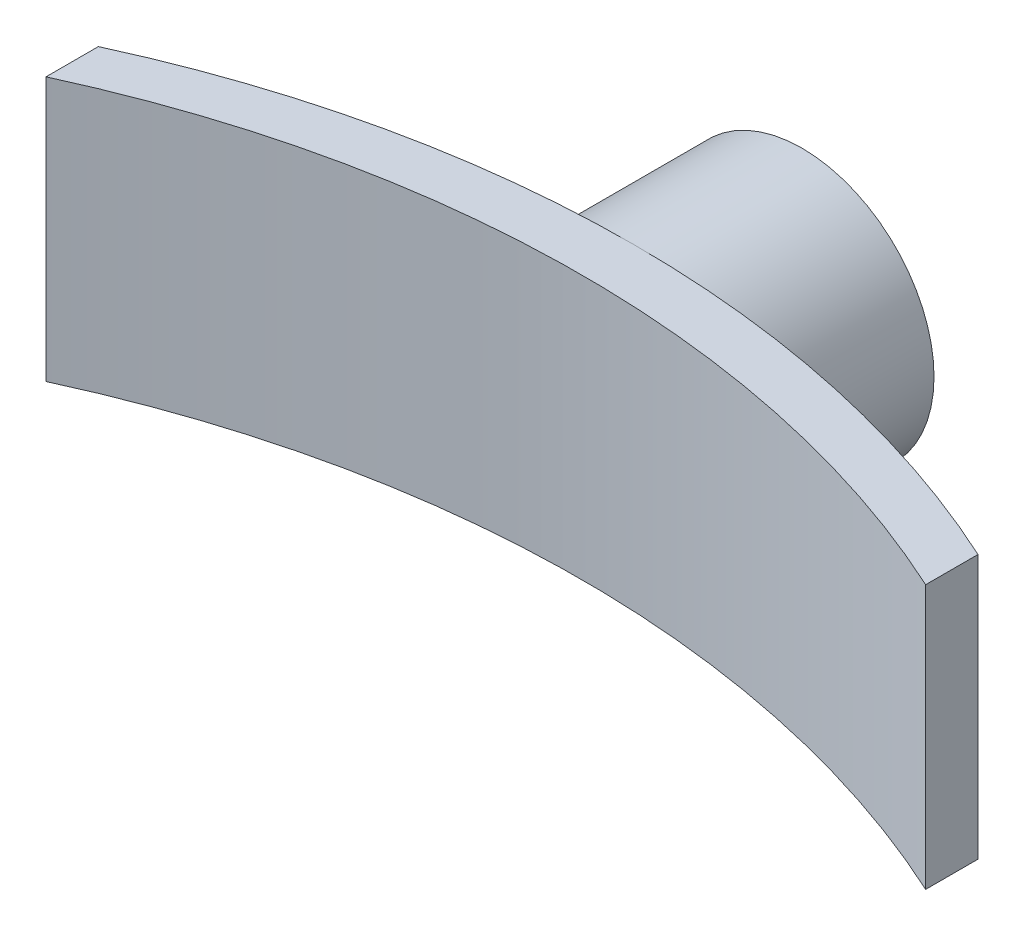
ISO-10303-21;
HEADER;
FILE_DESCRIPTION(('STEP AP214'),'2;1');
FILE_NAME('part.step','',(''),(''),'','','');
FILE_SCHEMA(('AUTOMOTIVE_DESIGN { 1 0 10303 214 1 1 1 1 }'));
ENDSEC;
DATA;
#1=APPLICATION_CONTEXT('core data for automotive mechanical design processes');
#2=APPLICATION_PROTOCOL_DEFINITION('international standard','automotive_design',2000,#1);
#3=PRODUCT_CONTEXT('',#1,'mechanical');
#4=PRODUCT('Part','Part','',(#3));
#5=PRODUCT_RELATED_PRODUCT_CATEGORY('part','',(#4));
#6=PRODUCT_DEFINITION_FORMATION('','',#4);
#7=PRODUCT_DEFINITION_CONTEXT('part definition',#1,'design');
#8=PRODUCT_DEFINITION('design','',#6,#7);
#9=PRODUCT_DEFINITION_SHAPE('','',#8);
#10=(LENGTH_UNIT() NAMED_UNIT(*) SI_UNIT(.MILLI.,.METRE.));
#11=(NAMED_UNIT(*) PLANE_ANGLE_UNIT() SI_UNIT($,.RADIAN.));
#12=(NAMED_UNIT(*) SI_UNIT($,.STERADIAN.) SOLID_ANGLE_UNIT());
#13=UNCERTAINTY_MEASURE_WITH_UNIT(LENGTH_MEASURE(1.E-05),#10,'distance_accuracy_value','');
#14=(GEOMETRIC_REPRESENTATION_CONTEXT(3) GLOBAL_UNCERTAINTY_ASSIGNED_CONTEXT((#13)) GLOBAL_UNIT_ASSIGNED_CONTEXT((#10,
#11,#12)) REPRESENTATION_CONTEXT('',''));
#15=CARTESIAN_POINT('',(0.,0.,0.));
#16=DIRECTION('',(0.,0.,1.));
#17=DIRECTION('',(1.,0.,0.));
#18=AXIS2_PLACEMENT_3D('',#15,#16,#17);
#19=CARTESIAN_POINT('',(0.,15.,138.685441024654));
#20=DIRECTION('',(0.,-1.,0.));
#21=DIRECTION('',(0.,0.,-1.));
#22=AXIS2_PLACEMENT_3D('',#19,#20,#21);
#23=CYLINDRICAL_SURFACE('',#22,119.634966003771);
#24=CARTESIAN_POINT('',(0.,-15.,138.685441024654));
#25=DIRECTION('',(0.,1.,0.));
#26=DIRECTION('',(0.,0.,1.));
#27=AXIS2_PLACEMENT_3D('',#24,#25,#26);
#28=CIRCLE('',#27,119.634966003771);
#29=CARTESIAN_POINT('',(50.,-15.,30.));
#30=VERTEX_POINT('',#29);
#31=CARTESIAN_POINT('',(0.,-15.,19.0504750208826));
#32=VERTEX_POINT('',#31);
#33=EDGE_CURVE('E93',#30,#32,#28,.T.);
#34=ORIENTED_EDGE('',*,*,#33,.T.);
#35=CARTESIAN_POINT('',(-15.,0.,19.9945606221414));
#36=CARTESIAN_POINT('',(-15.0000048297633,-0.419645091215443,19.99456229236));
#37=CARTESIAN_POINT('',(-14.9823835072018,-0.839219354657158,19.9923305711218));
#38=CARTESIAN_POINT('',(-14.9120337656221,-1.67550049008419,19.9834711187617));
#39=CARTESIAN_POINT('',(-14.8592973950176,-2.09220669101638,19.9768423919662));
#40=CARTESIAN_POINT('',(-14.719032338457,-2.92001939897791,19.9593691203172));
#41=CARTESIAN_POINT('',(-14.6314713819051,-3.33112034535046,19.9485206654107));
#42=CARTESIAN_POINT('',(-14.4222092568599,-4.14441584549623,19.9229213755418));
#43=CARTESIAN_POINT('',(-14.3005080970243,-4.54661040152801,19.9081705415691));
#44=CARTESIAN_POINT('',(-14.0239555181851,-5.3389730910945,19.8752010535054));
#45=CARTESIAN_POINT('',(-13.8691271517585,-5.72914937301504,19.8569848118964));
#46=CARTESIAN_POINT('',(-13.5273906518036,-6.49504026225926,19.8175969398735));
#47=CARTESIAN_POINT('',(-13.340482095909,-6.87075467909893,19.7964252705492));
#48=CARTESIAN_POINT('',(-12.9359617266996,-7.60503545625785,19.7517310710601));
#49=CARTESIAN_POINT('',(-12.7183555675124,-7.96360495821498,19.728208974048));
#50=CARTESIAN_POINT('',(-12.2539524107721,-8.66119080707835,19.6794738255989));
#51=CARTESIAN_POINT('',(-12.0071553850903,-9.00020713514234,19.6542607725325));
#52=CARTESIAN_POINT('',(-11.4847836220393,-9.65800301794134,19.6027217117517));
#53=CARTESIAN_POINT('',(-11.2090703344639,-9.97667216606313,19.5763907423995));
#54=CARTESIAN_POINT('',(-10.6318314620853,-10.5896840672006,19.523478861816));
#55=CARTESIAN_POINT('',(-10.3303057747809,-10.8840267236065,19.4968979495927));
#56=CARTESIAN_POINT('',(-9.70352824564511,-11.4463448461271,19.4442337373279));
#57=CARTESIAN_POINT('',(-9.37827524054865,-11.714319017975,19.418150461763));
#58=CARTESIAN_POINT('',(-8.70631903618782,-12.2220017069365,19.3672169125314));
#59=CARTESIAN_POINT('',(-8.35961582073267,-12.4617102027145,19.3423666397955));
#60=CARTESIAN_POINT('',(-7.64598441832916,-12.9119131677886,19.2945188251742));
#61=CARTESIAN_POINT('',(-7.27899260078468,-13.1223074795491,19.2715277426417));
#62=CARTESIAN_POINT('',(-6.52843051102123,-13.5114130080502,19.2281433374362));
#63=CARTESIAN_POINT('',(-6.14486018995756,-13.6901241314356,19.2077500224177));
#64=CARTESIAN_POINT('',(-5.36387171107389,-14.0145521891916,19.1701416420801));
#65=CARTESIAN_POINT('',(-4.96645395653608,-14.1602700835067,19.1529264842946));
#66=CARTESIAN_POINT('',(-4.16059835342893,-14.417639499442,19.1221645543267));
#67=CARTESIAN_POINT('',(-3.752160566962,-14.5292912129954,19.1086177614762));
#68=CARTESIAN_POINT('',(-2.92937506874225,-14.7171972344642,19.0856403270988));
#69=CARTESIAN_POINT('',(-2.51506983160761,-14.7936349382754,19.076188375208));
#70=CARTESIAN_POINT('',(-1.6814245605569,-14.9114056241703,19.0615651201498));
#71=CARTESIAN_POINT('',(-1.26208454250687,-14.9527387168494,19.0563938034965));
#72=CARTESIAN_POINT('',(-0.421397497431455,-14.9999888421127,19.0504787267864));
#73=CARTESIAN_POINT('',(-5.05412302096039E-05,-15.005907115341,19.0497348116297));
#74=CARTESIAN_POINT('',(0.841631858023303,-14.982286242833,19.0526952767451));
#75=CARTESIAN_POINT('',(1.26196730410946,-14.9527472035791,19.0563996436583));
#76=CARTESIAN_POINT('',(2.09624967574315,-14.8586999986219,19.0681182806827));
#77=CARTESIAN_POINT('',(2.51021923400308,-14.7943894042729,19.076108198345));
#78=CARTESIAN_POINT('',(3.33123484927159,-14.6314056434909,19.0961581001873));
#79=CARTESIAN_POINT('',(3.73828093644517,-14.5327326268125,19.1082180666297));
#80=CARTESIAN_POINT('',(4.54258693357236,-14.3017472075734,19.1360707516105));
#81=CARTESIAN_POINT('',(4.9398467141506,-14.1694343605543,19.1518635194675));
#82=CARTESIAN_POINT('',(5.72179470888925,-13.8721312549127,19.1867408662134));
#83=CARTESIAN_POINT('',(6.1064828716813,-13.7071408627874,19.2058254585508));
#84=CARTESIAN_POINT('',(6.86163192092546,-13.345178816002,19.2468104002197));
#85=CARTESIAN_POINT('',(7.23205156019883,-13.1481219591201,19.268718217819));
#86=CARTESIAN_POINT('',(7.95498974724141,-12.7237503412394,19.3146973697392));
#87=CARTESIAN_POINT('',(8.30750827466361,-12.4964355458493,19.3387687065192));
#88=CARTESIAN_POINT('',(8.99222272660967,-12.0131402824668,19.3884047090856));
#89=CARTESIAN_POINT('',(9.32441785933424,-11.7571586987149,19.4139694329787));
#90=CARTESIAN_POINT('',(9.96618263165715,-11.2183224213179,19.4658790414952));
#91=CARTESIAN_POINT('',(10.2757521618891,-10.9354675977897,19.492223929889));
#92=CARTESIAN_POINT('',(10.872178148859,-10.3428089267873,19.5451409402041));
#93=CARTESIAN_POINT('',(11.1588635896263,-10.0328329761059,19.571713377987));
#94=CARTESIAN_POINT('',(11.7051208026639,-9.38978831220435,19.6241519701445));
#95=CARTESIAN_POINT('',(11.9646924429434,-9.05671948658056,19.6500181210804));
#96=CARTESIAN_POINT('',(12.4548885346383,-8.36981387147465,19.7003092940268));
#97=CARTESIAN_POINT('',(12.6855128140142,-8.01597695858232,19.7247343074719));
#98=CARTESIAN_POINT('',(13.1161657520844,-7.29001478229278,19.7714459636339));
#99=CARTESIAN_POINT('',(13.3161944695897,-6.91788955405135,19.793732610461));
#100=CARTESIAN_POINT('',(13.6842925603756,-6.15780163905306,19.8355374668059));
#101=CARTESIAN_POINT('',(13.8523479363991,-5.76983210585522,19.8550544628831));
#102=CARTESIAN_POINT('',(14.155160424469,-4.98095741937975,19.8907450755208));
#103=CARTESIAN_POINT('',(14.2899175007474,-4.58005225220764,19.90691868849));
#104=CARTESIAN_POINT('',(14.5251293250313,-3.76818567136168,19.9354525682793));
#105=CARTESIAN_POINT('',(14.6255854347246,-3.35722465758144,19.9478129864747));
#106=CARTESIAN_POINT('',(14.7914491723722,-2.5281873861845,19.9683608807801));
#107=CARTESIAN_POINT('',(14.8568570106262,-2.11011117127659,19.9765483819288));
#108=CARTESIAN_POINT('',(14.951807121792,-1.27272060923652,19.9884704171227));
#109=CARTESIAN_POINT('',(14.9815899056199,-0.853433943910768,19.9922348092498));
#110=CARTESIAN_POINT('',(15.0058718473248,-0.0138247347406407,19.9953022039866));
#111=CARTESIAN_POINT('',(15.0003711639494,0.406497804434612,19.9946052266689));
#112=CARTESIAN_POINT('',(14.9541281384468,1.24515940660474,19.9887701285481));
#113=CARTESIAN_POINT('',(14.9133865184966,1.66349851006867,19.9836320987536));
#114=CARTESIAN_POINT('',(14.7969675555985,2.49521051941395,19.9690635711383));
#115=CARTESIAN_POINT('',(14.7212902323457,2.90858342809488,19.9596330757375));
#116=CARTESIAN_POINT('',(14.5358795596485,3.72602415550821,19.9367906020366));
#117=CARTESIAN_POINT('',(14.4262629916664,4.13011885476851,19.9233922833867));
#118=CARTESIAN_POINT('',(14.173694118687,4.92761007062675,19.8929848282459));
#119=CARTESIAN_POINT('',(14.0307419149679,5.32100661972306,19.8759757027254));
#120=CARTESIAN_POINT('',(13.71253188987,6.09436716260519,19.8388289524269));
#121=CARTESIAN_POINT('',(13.5372731855071,6.47433078891107,19.8186912421425));
#122=CARTESIAN_POINT('',(13.155704892134,7.21818254307436,19.7758562314904));
#123=CARTESIAN_POINT('',(12.9493951329935,7.58207058283861,19.7531589170985));
#124=CARTESIAN_POINT('',(12.5060054594309,8.29314864705988,19.7057164055031));
#125=CARTESIAN_POINT('',(12.2687679148206,8.6402397032474,19.6809609703637));
#126=CARTESIAN_POINT('',(11.7660556812221,9.31323502191705,19.6302066844179));
#127=CARTESIAN_POINT('',(11.5005809044222,9.63913921850753,19.604207829745));
#128=CARTESIAN_POINT('',(10.9432396851968,10.2675158832714,19.5516971910814));
#129=CARTESIAN_POINT('',(10.6513723309577,10.569987541224,19.5251853893944));
#130=CARTESIAN_POINT('',(10.0432803477796,11.149389763534,19.4723933866612));
#131=CARTESIAN_POINT('',(9.72705564439337,11.42632024982,19.4461131863232));
#132=CARTESIAN_POINT('',(9.07055588084702,11.9542230873101,19.3943721268717));
#133=CARTESIAN_POINT('',(8.73015308114019,12.205037158581,19.3689168426506));
#134=CARTESIAN_POINT('',(8.02930747384982,12.6770946211869,19.3197060318271));
#135=CARTESIAN_POINT('',(7.66886457783071,12.8983378820134,19.2959505127269));
#136=CARTESIAN_POINT('',(6.93047838458934,13.3096606120715,19.2508130975247));
#137=CARTESIAN_POINT('',(6.55253533520878,13.4997405224736,19.2294311678221));
#138=CARTESIAN_POINT('',(5.78181691794904,13.8473572119303,19.1896479642657));
#139=CARTESIAN_POINT('',(5.38904161281747,14.0048941286391,19.1712466778042));
#140=CARTESIAN_POINT('',(4.59253354558412,14.2858845575024,19.1379936940851));
#141=CARTESIAN_POINT('',(4.18883331391223,14.4094291546329,19.1231325254639));
#142=CARTESIAN_POINT('',(3.37233896619686,14.6220825826246,19.0973177102156));
#143=CARTESIAN_POINT('',(2.95954486061096,14.7111914530833,19.0863640590954));
#144=CARTESIAN_POINT('',(2.12784158151351,14.8543036246063,19.0686764116853));
#145=CARTESIAN_POINT('',(1.70893264132612,14.9083082615836,19.0619422548205));
#146=CARTESIAN_POINT('',(0.868006498253314,14.9808099032423,19.0528850172569));
#147=CARTESIAN_POINT('',(0.445989310789344,14.9993070839738,19.0505619146876));
#148=CARTESIAN_POINT('',(-0.395203247332182,15.000650068165,19.0503934995027));
#149=CARTESIAN_POINT('',(-0.814378243268414,14.983739685104,19.0525175640655));
#150=CARTESIAN_POINT('',(-1.64979418879952,14.9148866081732,19.0611217168799));
#151=CARTESIAN_POINT('',(-2.06603515276026,14.8629440859514,19.0676017837883));
#152=CARTESIAN_POINT('',(-2.8926212797815,14.7244134571636,19.0847356471981));
#153=CARTESIAN_POINT('',(-3.3029664630278,14.6378254692451,19.0953894294061));
#154=CARTESIAN_POINT('',(-4.11485804852386,14.430643350351,19.1205716117606));
#155=CARTESIAN_POINT('',(-4.51640443368496,14.3100491533363,19.1351000194314));
#156=CARTESIAN_POINT('',(-5.30772889232402,14.0357865975257,19.1676185967351));
#157=CARTESIAN_POINT('',(-5.69751117601068,13.8821302351809,19.1856075104895));
#158=CARTESIAN_POINT('',(-6.46273825480329,13.542827992324,19.2245482746997));
#159=CARTESIAN_POINT('',(-6.83818306243808,13.3571821397667,19.2455001225663));
#160=CARTESIAN_POINT('',(-7.5721346785225,12.9552244891368,19.2897834373273));
#161=CARTESIAN_POINT('',(-7.93064141715039,12.7389125646678,19.3131149140296));
#162=CARTESIAN_POINT('',(-8.62824530492567,12.2771476872079,19.3615090300855));
#163=CARTESIAN_POINT('',(-8.96734236150189,12.0316945952503,19.3865716776943));
#164=CARTESIAN_POINT('',(-9.62596112550499,11.5116499634181,19.4379009806258));
#165=CARTESIAN_POINT('',(-9.94533914968591,11.2368771088323,19.4641744803139));
#166=CARTESIAN_POINT('',(-10.5598484592339,10.6614625798983,19.517031525716));
#167=CARTESIAN_POINT('',(-10.8549795565765,10.360820704984,19.5436150738326));
#168=CARTESIAN_POINT('',(-11.4190034013356,9.73568852424121,19.5963494896357));
#169=CARTESIAN_POINT('',(-11.6878898022338,9.41119248307034,19.6225002514021));
#170=CARTESIAN_POINT('',(-12.1974525383823,8.74067852990167,19.6736229842759));
#171=CARTESIAN_POINT('',(-12.438129240026,8.39466089752019,19.6985949706911));
#172=CARTESIAN_POINT('',(-12.8904544513382,7.68211896824334,19.7467457593434));
#173=CARTESIAN_POINT('',(-13.1019859844197,7.31551989724446,19.7699171815235));
#174=CARTESIAN_POINT('',(-13.4933773147061,6.56564183322779,19.8136922606904));
#175=CARTESIAN_POINT('',(-13.6732370863281,6.18236282673707,19.8342959156031));
#176=CARTESIAN_POINT('',(-13.9998133219626,5.40220800338393,19.8723215840014));
#177=CARTESIAN_POINT('',(-14.1465616940816,5.00534570471626,19.8897466574271));
#178=CARTESIAN_POINT('',(-14.4060166407827,4.20064530175981,19.9209311628033));
#179=CARTESIAN_POINT('',(-14.5187312446467,3.79280981104476,19.9346914592612));
#180=CARTESIAN_POINT('',(-14.7420796606226,2.82730699071762,19.9621782107943));
#181=CARTESIAN_POINT('',(-14.8387000326869,2.26629260308312,19.9742695238868));
#182=CARTESIAN_POINT('',(-14.9676566858645,1.13680880101804,19.9904595679636));
#183=CARTESIAN_POINT('',(-14.9999934588894,0.568339443667946,19.9945583601084));
#184=CARTESIAN_POINT('',(-15.,0.,19.9945606221414));
#185=B_SPLINE_CURVE_WITH_KNOTS('',3,(#35,#36,#37,#38,#39,#40,#41,#42,#43,#44,#45,#46,#47,#48,
#49,#50,#51,#52,#53,#54,#55,#56,#57,#58,#59,#60,#61,#62,#63,#64,#65,#66,#67,#68,#69,#70,#71,#72,
#73,#74,#75,#76,#77,#78,#79,#80,#81,#82,#83,#84,#85,#86,#87,#88,#89,#90,#91,#92,#93,#94,#95,#96,
#97,#98,#99,#100,#101,#102,#103,#104,#105,#106,#107,#108,#109,#110,#111,#112,#113,#114,#115,
#116,#117,#118,#119,#120,#121,#122,#123,#124,#125,#126,#127,#128,#129,#130,#131,#132,#133,#134,
#135,#136,#137,#138,#139,#140,#141,#142,#143,#144,#145,#146,#147,#148,#149,#150,#151,#152,#153,
#154,#155,#156,#157,#158,#159,#160,#161,#162,#163,#164,#165,#166,#167,#168,#169,#170,#171,#172,
#173,#174,#175,#176,#177,#178,#179,#180,#181,#182,#183,#184),.UNSPECIFIED.,.T.,.F.,(4,2,2,2,2,2,
2,2,2,2,2,2,2,2,2,2,2,2,2,2,2,2,2,2,2,2,2,2,2,2,2,2,2,2,2,2,2,2,2,2,2,2,2,2,2,2,2,2,2,2,2,2,2,2,
2,2,2,2,2,2,2,2,2,2,2,2,2,2,2,2,2,2,2,2,4),(0.,1.25843782106496,2.51716070457626,
3.77705272572232,5.0369444273713,6.29596222997953,7.55499661003065,8.81379939321137,
10.0726033894056,11.3377412044743,12.6028840436465,13.8680889499578,15.1332948112672,
16.4027227071892,17.6721543434408,18.941549040576,20.2109365856451,21.4736362218079,
22.7363318798841,23.9989833032252,25.2616309346805,26.5171784843569,27.7727205623105,
29.0282792296823,30.2838430266982,31.5427990910747,32.8017565863911,34.0607630994864,
35.3197756978944,36.5874548182033,37.8551401093268,39.1228329341791,40.3905233222291,
41.658767407894,42.9270128558562,44.1952079508565,45.4633954362339,46.7229719540787,
47.9825428048286,49.2420878443511,50.5016321738013,51.7568898210049,53.0121436546157,
54.2674318012521,55.5227268259324,56.7846900057534,58.0466571101232,59.3086678297446,
60.5706824068088,61.8399477058403,63.1092186064968,64.3784715369049,65.6477190983594,
66.9135317383741,68.1793429228323,69.4451059332527,70.7108626678619,71.9679321811423,
73.224995535164,74.4820545842612,75.7391160745481,76.9957222128472,78.2523272530313,
79.5089374727129,80.7655536850844,82.0304486649652,83.2953534526354,84.5605633669048,
85.8257568465415,87.0958889177813,88.366022014967,89.634925858878,90.9035301073588,
92.6078877637735,94.3122323780361),.UNSPECIFIED.);
#186=CARTESIAN_POINT('',(0.,15.,19.0504750208826));
#187=VERTEX_POINT('',#186);
#188=EDGE_CURVE('E57',#32,#187,#185,.T.);
#189=ORIENTED_EDGE('',*,*,#188,.T.);
#190=CARTESIAN_POINT('',(0.,15.,138.685441024654));
#191=DIRECTION('',(0.,1.,0.));
#192=DIRECTION('',(0.,0.,1.));
#193=AXIS2_PLACEMENT_3D('',#190,#191,#192);
#194=CIRCLE('',#193,119.634966003771);
#195=CARTESIAN_POINT('',(50.,15.,30.));
#196=VERTEX_POINT('',#195);
#197=EDGE_CURVE('E116',#196,#187,#194,.T.);
#198=ORIENTED_EDGE('',*,*,#197,.F.);
#199=DIRECTION('',(0.,-1.,0.));
#200=VECTOR('',#199,1.);
#201=CARTESIAN_POINT('',(50.,15.,30.));
#202=LINE('',#201,#200);
#203=EDGE_CURVE('E124',#196,#30,#202,.T.);
#204=ORIENTED_EDGE('',*,*,#203,.T.);
#205=EDGE_LOOP('',(#34,#189,#198,#204));
#206=FACE_BOUND('',#205,.T.);
#207=ADVANCED_FACE('F33',(#206),#23,.T.);
#208=CARTESIAN_POINT('',(-50.,15.,30.));
#209=VERTEX_POINT('',#208);
#210=EDGE_CURVE('E115',#187,#209,#194,.T.);
#211=ORIENTED_EDGE('',*,*,#210,.F.);
#212=EDGE_CURVE('E54',#187,#32,#185,.T.);
#213=ORIENTED_EDGE('',*,*,#212,.T.);
#214=CARTESIAN_POINT('',(-50.,-15.,30.));
#215=VERTEX_POINT('',#214);
#216=EDGE_CURVE('E84',#32,#215,#28,.T.);
#217=ORIENTED_EDGE('',*,*,#216,.T.);
#218=DIRECTION('',(0.,-1.,0.));
#219=VECTOR('',#218,1.);
#220=CARTESIAN_POINT('',(-50.,15.,30.));
#221=LINE('',#220,#219);
#222=EDGE_CURVE('E88',#209,#215,#221,.T.);
#223=ORIENTED_EDGE('',*,*,#222,.F.);
#224=EDGE_LOOP('',(#211,#213,#217,#223));
#225=FACE_BOUND('',#224,.T.);
#226=ADVANCED_FACE('F87',(#225),#23,.T.);
#227=CARTESIAN_POINT('',(-50.,15.,35.9495249791174));
#228=DIRECTION('',(1.,0.,0.));
#229=DIRECTION('',(0.,0.,-1.));
#230=AXIS2_PLACEMENT_3D('',#227,#228,#229);
#231=PLANE('',#230);
#232=ORIENTED_EDGE('',*,*,#222,.T.);
#233=DIRECTION('',(0.,0.,1.));
#234=VECTOR('',#233,1.);
#235=CARTESIAN_POINT('',(-50.,-15.,35.9495249791174));
#236=LINE('',#235,#234);
#237=CARTESIAN_POINT('',(-49.9999999999999,-15.,35.9495249791174));
#238=VERTEX_POINT('',#237);
#239=EDGE_CURVE('E100',#215,#238,#236,.T.);
#240=ORIENTED_EDGE('',*,*,#239,.T.);
#241=DIRECTION('',(0.,-1.,0.));
#242=VECTOR('',#241,1.);
#243=CARTESIAN_POINT('',(-49.9999999999999,15.,35.9495249791174));
#244=LINE('',#243,#242);
#245=CARTESIAN_POINT('',(-49.9999999999999,15.,35.9495249791174));
#246=VERTEX_POINT('',#245);
#247=EDGE_CURVE('E102',#246,#238,#244,.T.);
#248=ORIENTED_EDGE('',*,*,#247,.F.);
#249=DIRECTION('',(0.,0.,1.));
#250=VECTOR('',#249,1.);
#251=CARTESIAN_POINT('',(-50.,15.,35.9495249791174));
#252=LINE('',#251,#250);
#253=EDGE_CURVE('E101',#209,#246,#252,.T.);
#254=ORIENTED_EDGE('',*,*,#253,.F.);
#255=EDGE_LOOP('',(#232,#240,#248,#254));
#256=FACE_BOUND('',#255,.T.);
#257=ADVANCED_FACE('F98',(#256),#231,.F.);
#258=CARTESIAN_POINT('',(0.,15.,144.634966003771));
#259=DIRECTION('',(0.,-1.,0.));
#260=DIRECTION('',(0.,0.,-1.));
#261=AXIS2_PLACEMENT_3D('',#258,#259,#260);
#262=CYLINDRICAL_SURFACE('',#261,119.634966003771);
#263=ORIENTED_EDGE('',*,*,#247,.T.);
#264=CARTESIAN_POINT('',(0.,-15.,144.634966003771));
#265=DIRECTION('',(0.,-1.,0.));
#266=DIRECTION('',(0.,0.,1.));
#267=AXIS2_PLACEMENT_3D('',#264,#265,#266);
#268=CIRCLE('',#267,119.634966003771);
#269=CARTESIAN_POINT('',(50.,-15.,35.9495249791174));
#270=VERTEX_POINT('',#269);
#271=EDGE_CURVE('E108',#238,#270,#268,.T.);
#272=ORIENTED_EDGE('',*,*,#271,.T.);
#273=DIRECTION('',(0.,-1.,0.));
#274=VECTOR('',#273,1.);
#275=CARTESIAN_POINT('',(50.,15.,35.9495249791174));
#276=LINE('',#275,#274);
#277=CARTESIAN_POINT('',(50.,15.,35.9495249791174));
#278=VERTEX_POINT('',#277);
#279=EDGE_CURVE('E126',#278,#270,#276,.T.);
#280=ORIENTED_EDGE('',*,*,#279,.F.);
#281=CARTESIAN_POINT('',(0.,15.,144.634966003771));
#282=DIRECTION('',(0.,-1.,0.));
#283=DIRECTION('',(0.,0.,1.));
#284=AXIS2_PLACEMENT_3D('',#281,#282,#283);
#285=CIRCLE('',#284,119.634966003771);
#286=EDGE_CURVE('E120',#246,#278,#285,.T.);
#287=ORIENTED_EDGE('',*,*,#286,.F.);
#288=EDGE_LOOP('',(#263,#272,#280,#287));
#289=FACE_BOUND('',#288,.T.);
#290=ADVANCED_FACE('F164',(#289),#262,.F.);
#291=CARTESIAN_POINT('',(50.,15.,35.9495249791174));
#292=DIRECTION('',(-1.,0.,0.));
#293=DIRECTION('',(0.,0.,1.));
#294=AXIS2_PLACEMENT_3D('',#291,#292,#293);
#295=PLANE('',#294);
#296=ORIENTED_EDGE('',*,*,#279,.T.);
#297=DIRECTION('',(0.,0.,-1.));
#298=VECTOR('',#297,1.);
#299=CARTESIAN_POINT('',(50.,-15.,35.9495249791174));
#300=LINE('',#299,#298);
#301=EDGE_CURVE('E110',#270,#30,#300,.T.);
#302=ORIENTED_EDGE('',*,*,#301,.T.);
#303=ORIENTED_EDGE('',*,*,#203,.F.);
#304=DIRECTION('',(0.,0.,-1.));
#305=VECTOR('',#304,1.);
#306=CARTESIAN_POINT('',(50.,15.,35.9495249791174));
#307=LINE('',#306,#305);
#308=EDGE_CURVE('E122',#278,#196,#307,.T.);
#309=ORIENTED_EDGE('',*,*,#308,.F.);
#310=EDGE_LOOP('',(#296,#302,#303,#309));
#311=FACE_BOUND('',#310,.T.);
#312=ADVANCED_FACE('F159',(#311),#295,.F.);
#313=CARTESIAN_POINT('',(0.,15.,138.685441024654));
#314=DIRECTION('',(0.,1.,0.));
#315=DIRECTION('',(0.,0.,1.));
#316=AXIS2_PLACEMENT_3D('',#313,#314,#315);
#317=PLANE('',#316);
#318=ORIENTED_EDGE('',*,*,#197,.T.);
#319=ORIENTED_EDGE('',*,*,#210,.T.);
#320=ORIENTED_EDGE('',*,*,#253,.T.);
#321=ORIENTED_EDGE('',*,*,#286,.T.);
#322=ORIENTED_EDGE('',*,*,#308,.T.);
#323=EDGE_LOOP('',(#318,#319,#320,#321,#322));
#324=FACE_BOUND('',#323,.T.);
#325=ADVANCED_FACE('F166',(#324),#317,.T.);
#326=CARTESIAN_POINT('',(0.,-15.,138.685441024654));
#327=DIRECTION('',(0.,1.,0.));
#328=DIRECTION('',(0.,0.,1.));
#329=AXIS2_PLACEMENT_3D('',#326,#327,#328);
#330=PLANE('',#329);
#331=ORIENTED_EDGE('',*,*,#216,.F.);
#332=ORIENTED_EDGE('',*,*,#33,.F.);
#333=ORIENTED_EDGE('',*,*,#301,.F.);
#334=ORIENTED_EDGE('',*,*,#271,.F.);
#335=ORIENTED_EDGE('',*,*,#239,.F.);
#336=EDGE_LOOP('',(#331,#332,#333,#334,#335));
#337=FACE_BOUND('',#336,.T.);
#338=ADVANCED_FACE('F105',(#337),#330,.F.);
#339=CARTESIAN_POINT('',(0.,0.,20.));
#340=DIRECTION('',(0.,0.,-1.));
#341=DIRECTION('',(-1.,0.,0.));
#342=AXIS2_PLACEMENT_3D('',#339,#340,#341);
#343=CYLINDRICAL_SURFACE('',#342,15.);
#344=CARTESIAN_POINT('',(0.,0.,0.));
#345=DIRECTION('',(0.,0.,1.));
#346=DIRECTION('',(1.,0.,0.));
#347=AXIS2_PLACEMENT_3D('',#344,#345,#346);
#348=CIRCLE('',#347,15.);
#349=CARTESIAN_POINT('',(15.,0.,0.));
#350=VERTEX_POINT('',#349);
#351=EDGE_CURVE('E11',#350,#350,#348,.T.);
#352=ORIENTED_EDGE('',*,*,#351,.T.);
#353=EDGE_LOOP('',(#352));
#354=FACE_BOUND('',#353,.T.);
#355=ORIENTED_EDGE('',*,*,#188,.F.);
#356=ORIENTED_EDGE('',*,*,#212,.F.);
#357=EDGE_LOOP('',(#355,#356));
#358=FACE_BOUND('',#357,.T.);
#359=ADVANCED_FACE('F35',(#354,#358),#343,.T.);
#360=CARTESIAN_POINT('',(0.,0.,20.));
#361=DIRECTION('',(0.,0.,-1.));
#362=DIRECTION('',(-1.,0.,0.));
#363=AXIS2_PLACEMENT_3D('',#360,#361,#362);
#364=CYLINDRICAL_SURFACE('',#363,2.55);
#365=CARTESIAN_POINT('',(0.,0.,0.));
#366=DIRECTION('',(0.,0.,1.));
#367=DIRECTION('',(1.,0.,0.));
#368=AXIS2_PLACEMENT_3D('',#365,#366,#367);
#369=CIRCLE('',#368,2.55);
#370=CARTESIAN_POINT('',(2.55,0.,0.));
#371=VERTEX_POINT('',#370);
#372=EDGE_CURVE('E48',#371,#371,#369,.T.);
#373=ORIENTED_EDGE('',*,*,#372,.F.);
#374=EDGE_LOOP('',(#373));
#375=FACE_BOUND('',#374,.T.);
#376=CARTESIAN_POINT('',(-2.55,0.,19.0776545276055));
#377=CARTESIAN_POINT('',(-2.54999365428206,-0.143217163036178,19.0776541604424));
#378=CARTESIAN_POINT('',(-2.53789412237283,-0.286537757961222,19.0773945347273));
#379=CARTESIAN_POINT('',(-2.48979526289531,-0.569230626480821,19.0763838148649));
#380=CARTESIAN_POINT('',(-2.45376727857734,-0.708597956711793,19.0756321314442));
#381=CARTESIAN_POINT('',(-2.35883868874112,-0.979247953639066,19.0737224862604));
#382=CARTESIAN_POINT('',(-2.29994914170031,-1.11053449361609,19.0725647209511));
#383=CARTESIAN_POINT('',(-2.16098461479709,-1.36132108867622,19.0699736210768));
#384=CARTESIAN_POINT('',(-2.0809148542311,-1.48082403756405,19.0685403544254));
#385=CARTESIAN_POINT('',(-1.90183315467887,-1.70472431369599,19.0655592362057));
#386=CARTESIAN_POINT('',(-1.80281655010993,-1.80911790917968,19.064011356472));
#387=CARTESIAN_POINT('',(-1.58865882000042,-1.99980514254963,19.0609757275795));
#388=CARTESIAN_POINT('',(-1.47351705705126,-2.08609806460056,19.0594879808006));
#389=CARTESIAN_POINT('',(-1.23036926870781,-2.23813582563612,19.0567402754658));
#390=CARTESIAN_POINT('',(-1.10236225962013,-2.30387909178542,19.0554803343488));
#391=CARTESIAN_POINT('',(-0.837124780694965,-2.41294081366466,19.0533304355382));
#392=CARTESIAN_POINT('',(-0.699894338704755,-2.45625933709567,19.0524404767276));
#393=CARTESIAN_POINT('',(-0.420127488398728,-2.51923572443243,19.0511309887803));
#394=CARTESIAN_POINT('',(-0.277591890409416,-2.53889718662768,19.0507113881019));
#395=CARTESIAN_POINT('',(0.00875737495081822,-2.55401239467243,19.0503896797843));
#396=CARTESIAN_POINT('',(0.152571038605889,-2.54946621088029,19.0504875706409));
#397=CARTESIAN_POINT('',(0.437369670723248,-2.51629828818622,19.0511897471507));
#398=CARTESIAN_POINT('',(0.578355094213593,-2.48768045443528,19.0517939506646));
#399=CARTESIAN_POINT('',(0.853520101509374,-2.40718761568402,19.0534405511516));
#400=CARTESIAN_POINT('',(0.987699674196812,-2.35531257269222,19.0544829488406));
#401=CARTESIAN_POINT('',(1.24545654513896,-2.22977339162561,19.0568885764391));
#402=CARTESIAN_POINT('',(1.36903297081482,-2.15610746249888,19.058251832719));
#403=CARTESIAN_POINT('',(1.60206602541426,-1.98907899345297,19.0611455113538));
#404=CARTESIAN_POINT('',(1.71152264087445,-1.89571643475305,19.062675933868));
#405=CARTESIAN_POINT('',(1.91323178702664,-1.69192280828841,19.0657317965141));
#406=CARTESIAN_POINT('',(2.00548088949328,-1.58148834731322,19.0672572355936));
#407=CARTESIAN_POINT('',(2.17012997787258,-1.34669776090056,19.0701308443301));
#408=CARTESIAN_POINT('',(2.24252996089159,-1.22234163343357,19.0714790139611));
#409=CARTESIAN_POINT('',(2.36542520961028,-0.96323589816882,19.0738460560789));
#410=CARTESIAN_POINT('',(2.41592036959469,-0.828486240214357,19.0748649269763));
#411=CARTESIAN_POINT('',(2.49357039816808,-0.552419405096802,19.0764584250449));
#412=CARTESIAN_POINT('',(2.52072529937125,-0.411102237111022,19.0770330528369));
#413=CARTESIAN_POINT('',(2.55091977797192,-0.125941718491917,19.0776731656933));
#414=CARTESIAN_POINT('',(2.55396410080867,0.0179011294516628,19.0777387509473));
#415=CARTESIAN_POINT('',(2.5358633656794,0.304055950581834,19.0773536454052));
#416=CARTESIAN_POINT('',(2.51471832131434,0.446367924629146,19.0769029548994));
#417=CARTESIAN_POINT('',(2.44884301761003,0.725408007406491,19.0755361981073));
#418=CARTESIAN_POINT('',(2.40411491000474,0.862136624339555,19.0746201742785));
#419=CARTESIAN_POINT('',(2.29234535122627,1.12614429511777,19.0724260560724));
#420=CARTESIAN_POINT('',(2.22530387879631,1.25342333996067,19.0711479613502));
#421=CARTESIAN_POINT('',(2.07079843772127,1.49494069824762,19.0683735438744));
#422=CARTESIAN_POINT('',(1.98333127194789,1.60917696600101,19.0668771869711));
#423=CARTESIAN_POINT('',(1.79046202928265,1.82134546062553,19.0638350600424));
#424=CARTESIAN_POINT('',(1.68505992570675,1.91927766323862,19.0622892899435));
#425=CARTESIAN_POINT('',(1.45929251320594,2.09607384571027,19.0593223098465));
#426=CARTESIAN_POINT('',(1.33892480647096,2.17493476396418,19.0579011198713));
#427=CARTESIAN_POINT('',(1.08665536090106,2.31132880961814,19.0553438021072));
#428=CARTESIAN_POINT('',(0.954753641227389,2.36886197244879,19.0542076738448));
#429=CARTESIAN_POINT('',(0.68317196782541,2.46096200978569,19.052348654732));
#430=CARTESIAN_POINT('',(0.543492690075954,2.49553087684485,19.0516257280299));
#431=CARTESIAN_POINT('',(0.260311199949008,2.54072758617913,19.050674467744));
#432=CARTESIAN_POINT('',(0.116808985848723,2.5513554176651,19.0504461343833));
#433=CARTESIAN_POINT('',(-0.169913954341787,2.54836809083267,19.0505098005945));
#434=CARTESIAN_POINT('',(-0.313134730960886,2.53475777758961,19.0508016961755));
#435=CARTESIAN_POINT('',(-0.595258140004554,2.48369042797943,19.0518727172515));
#436=CARTESIAN_POINT('',(-0.734160763805071,2.44623334398964,19.0526518437193));
#437=CARTESIAN_POINT('',(-1.00370786753967,2.34853595392235,19.0546095368482));
#438=CARTESIAN_POINT('',(-1.13435219916085,2.28829523880302,19.0557881106805));
#439=CARTESIAN_POINT('',(-1.38366903153052,2.14674355266646,19.058411833434));
#440=CARTESIAN_POINT('',(-1.50234198336008,2.06543337595794,19.0598569723053));
#441=CARTESIAN_POINT('',(-1.72436659733123,1.88404149238573,19.0628511766904));
#442=CARTESIAN_POINT('',(-1.8277168259885,1.7839580312094,19.0644002519081));
#443=CARTESIAN_POINT('',(-2.01617522944633,1.56783161997192,19.0674280106576));
#444=CARTESIAN_POINT('',(-2.10127887249079,1.45178471692132,19.0689066766317));
#445=CARTESIAN_POINT('',(-2.25083586669194,1.20699269270644,19.0716272556068));
#446=CARTESIAN_POINT('',(-2.31527755562051,1.07824045369272,19.0728690347423));
#447=CARTESIAN_POINT('',(-2.42155562059526,0.81184196341835,19.0749732076557));
#448=CARTESIAN_POINT('',(-2.4634190239421,0.674206567801836,19.0758360548027));
#449=CARTESIAN_POINT('',(-2.5122265949247,0.446414916155166,19.0768538117281));
#450=CARTESIAN_POINT('',(-2.52637387039449,0.357738010491295,19.0771527811057));
#451=CARTESIAN_POINT('',(-2.54526255978269,0.179387598747068,19.0775532540291));
#452=CARTESIAN_POINT('',(-2.55000397508452,0.0897140928132989,19.0776547576038));
#453=CARTESIAN_POINT('',(-2.55,0.,19.0776545276055));
#454=B_SPLINE_CURVE_WITH_KNOTS('',3,(#376,#377,#378,#379,#380,#381,#382,#383,#384,#385,#386,
#387,#388,#389,#390,#391,#392,#393,#394,#395,#396,#397,#398,#399,#400,#401,#402,#403,#404,#405,
#406,#407,#408,#409,#410,#411,#412,#413,#414,#415,#416,#417,#418,#419,#420,#421,#422,#423,#424,
#425,#426,#427,#428,#429,#430,#431,#432,#433,#434,#435,#436,#437,#438,#439,#440,#441,#442,#443,
#444,#445,#446,#447,#448,#449,#450,#451,#452,#453),.UNSPECIFIED.,.T.,.F.,(4,2,2,2,2,2,2,2,2,2,2,
2,2,2,2,2,2,2,2,2,2,2,2,2,2,2,2,2,2,2,2,2,2,2,2,2,2,2,4),(0.,0.429324026888347,
0.859163142218777,1.28879459653611,1.71832027815507,2.1479518651433,2.57760043976008,
3.00728189089238,3.436962044794,3.86657683516203,4.29619037687577,4.72573423569504,
5.15527879619202,5.58485867193372,6.01443895728145,6.44410473602774,6.87377057741155,
7.30343849239014,7.73310580697719,8.16268855242688,8.59227105633511,9.02181437163833,
9.45135809614608,9.88096910003351,10.3105807431125,10.7402613080927,11.1699411592657,
11.599583723351,12.0292264810567,12.4587833651158,12.8883411070146,13.317906561267,
13.7474558234611,14.177045245887,14.6067412386685,15.0366793395726,15.4661016349959,
15.7350388241134,16.003975973675),.UNSPECIFIED.);
#455=CARTESIAN_POINT('',(-2.55,0.,19.0776545276055));
#456=VERTEX_POINT('',#455);
#457=EDGE_CURVE('E38',#456,#456,#454,.T.);
#458=ORIENTED_EDGE('',*,*,#457,.T.);
#459=EDGE_LOOP('',(#458));
#460=FACE_BOUND('',#459,.T.);
#461=ADVANCED_FACE('F140',(#375,#460),#364,.F.);
#462=CARTESIAN_POINT('',(0.,0.,0.));
#463=DIRECTION('',(0.,0.,1.));
#464=DIRECTION('',(1.,0.,0.));
#465=AXIS2_PLACEMENT_3D('',#462,#463,#464);
#466=PLANE('',#465);
#467=ORIENTED_EDGE('',*,*,#351,.F.);
#468=EDGE_LOOP('',(#467));
#469=FACE_BOUND('',#468,.T.);
#470=ORIENTED_EDGE('',*,*,#372,.T.);
#471=EDGE_LOOP('',(#470));
#472=FACE_BOUND('',#471,.T.);
#473=ADVANCED_FACE('F137',(#469,#472),#466,.F.);
#474=ORIENTED_EDGE('',*,*,#457,.F.);
#475=EDGE_LOOP('',(#474));
#476=FACE_BOUND('',#475,.T.);
#477=ADVANCED_FACE('F133',(#476),#23,.T.);
#478=CLOSED_SHELL('',(#207,#226,#257,#290,#312,#325,#338,#359,#461,#473,#477));
#479=MANIFOLD_SOLID_BREP('B2',#478);
#480=ADVANCED_BREP_SHAPE_REPRESENTATION('',(#18,#479),#14);
#481=SHAPE_DEFINITION_REPRESENTATION(#9,#480);
ENDSEC;
END-ISO-10303-21;
